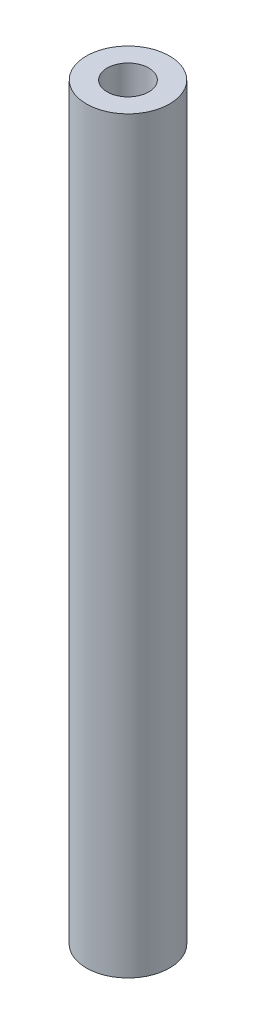
ISO-10303-21;
HEADER;
FILE_DESCRIPTION(('STEP AP214'),'2;1');
FILE_NAME('part.step','',(''),(''),'','','');
FILE_SCHEMA(('AUTOMOTIVE_DESIGN { 1 0 10303 214 1 1 1 1 }'));
ENDSEC;
DATA;
#1=APPLICATION_CONTEXT('core data for automotive mechanical design processes');
#2=APPLICATION_PROTOCOL_DEFINITION('international standard','automotive_design',2000,#1);
#3=PRODUCT_CONTEXT('',#1,'mechanical');
#4=PRODUCT('Part','Part','',(#3));
#5=PRODUCT_RELATED_PRODUCT_CATEGORY('part','',(#4));
#6=PRODUCT_DEFINITION_FORMATION('','',#4);
#7=PRODUCT_DEFINITION_CONTEXT('part definition',#1,'design');
#8=PRODUCT_DEFINITION('design','',#6,#7);
#9=PRODUCT_DEFINITION_SHAPE('','',#8);
#10=(LENGTH_UNIT() NAMED_UNIT(*) SI_UNIT(.MILLI.,.METRE.));
#11=(NAMED_UNIT(*) PLANE_ANGLE_UNIT() SI_UNIT($,.RADIAN.));
#12=(NAMED_UNIT(*) SI_UNIT($,.STERADIAN.) SOLID_ANGLE_UNIT());
#13=UNCERTAINTY_MEASURE_WITH_UNIT(LENGTH_MEASURE(1.E-05),#10,'distance_accuracy_value','');
#14=(GEOMETRIC_REPRESENTATION_CONTEXT(3) GLOBAL_UNCERTAINTY_ASSIGNED_CONTEXT((#13)) GLOBAL_UNIT_ASSIGNED_CONTEXT((#10,
#11,#12)) REPRESENTATION_CONTEXT('',''));
#15=CARTESIAN_POINT('',(0.,0.,0.));
#16=DIRECTION('',(0.,0.,1.));
#17=DIRECTION('',(1.,0.,0.));
#18=AXIS2_PLACEMENT_3D('',#15,#16,#17);
#19=CARTESIAN_POINT('',(0.,90.,0.));
#20=DIRECTION('',(0.,1.,0.));
#21=DIRECTION('',(0.,0.,1.));
#22=AXIS2_PLACEMENT_3D('',#19,#20,#21);
#23=PLANE('',#22);
#24=CARTESIAN_POINT('',(0.,90.,0.));
#25=DIRECTION('',(0.,1.,0.));
#26=DIRECTION('',(0.,0.,1.));
#27=AXIS2_PLACEMENT_3D('',#24,#25,#26);
#28=CIRCLE('',#27,5.);
#29=CARTESIAN_POINT('',(0.,90.,5.));
#30=VERTEX_POINT('',#29);
#31=EDGE_CURVE('E10',#30,#30,#28,.T.);
#32=ORIENTED_EDGE('',*,*,#31,.T.);
#33=EDGE_LOOP('',(#32));
#34=FACE_BOUND('',#33,.T.);
#35=CARTESIAN_POINT('',(0.,90.,0.));
#36=DIRECTION('',(0.,1.,0.));
#37=DIRECTION('',(0.,0.,1.));
#38=AXIS2_PLACEMENT_3D('',#35,#36,#37);
#39=CIRCLE('',#38,2.5);
#40=CARTESIAN_POINT('',(0.,90.,2.5));
#41=VERTEX_POINT('',#40);
#42=EDGE_CURVE('E41',#41,#41,#39,.T.);
#43=ORIENTED_EDGE('',*,*,#42,.F.);
#44=EDGE_LOOP('',(#43));
#45=FACE_BOUND('',#44,.T.);
#46=ADVANCED_FACE('F30',(#34,#45),#23,.T.);
#47=CARTESIAN_POINT('',(0.,0.,0.));
#48=DIRECTION('',(0.,1.,0.));
#49=DIRECTION('',(0.,0.,1.));
#50=AXIS2_PLACEMENT_3D('',#47,#48,#49);
#51=PLANE('',#50);
#52=CARTESIAN_POINT('',(0.,0.,0.));
#53=DIRECTION('',(0.,1.,0.));
#54=DIRECTION('',(0.,0.,1.));
#55=AXIS2_PLACEMENT_3D('',#52,#53,#54);
#56=CIRCLE('',#55,5.);
#57=CARTESIAN_POINT('',(0.,0.,5.));
#58=VERTEX_POINT('',#57);
#59=EDGE_CURVE('E34',#58,#58,#56,.T.);
#60=ORIENTED_EDGE('',*,*,#59,.F.);
#61=EDGE_LOOP('',(#60));
#62=FACE_BOUND('',#61,.T.);
#63=CARTESIAN_POINT('',(0.,0.,0.));
#64=DIRECTION('',(0.,1.,0.));
#65=DIRECTION('',(0.,0.,1.));
#66=AXIS2_PLACEMENT_3D('',#63,#64,#65);
#67=CIRCLE('',#66,2.5);
#68=CARTESIAN_POINT('',(0.,0.,2.5));
#69=VERTEX_POINT('',#68);
#70=EDGE_CURVE('E43',#69,#69,#67,.T.);
#71=ORIENTED_EDGE('',*,*,#70,.T.);
#72=EDGE_LOOP('',(#71));
#73=FACE_BOUND('',#72,.T.);
#74=ADVANCED_FACE('F53',(#62,#73),#51,.F.);
#75=CARTESIAN_POINT('',(0.,90.,0.));
#76=DIRECTION('',(0.,-1.,0.));
#77=DIRECTION('',(0.,0.,-1.));
#78=AXIS2_PLACEMENT_3D('',#75,#76,#77);
#79=CYLINDRICAL_SURFACE('',#78,5.);
#80=ORIENTED_EDGE('',*,*,#31,.F.);
#81=EDGE_LOOP('',(#80));
#82=FACE_BOUND('',#81,.T.);
#83=ORIENTED_EDGE('',*,*,#59,.T.);
#84=EDGE_LOOP('',(#83));
#85=FACE_BOUND('',#84,.T.);
#86=ADVANCED_FACE('F32',(#82,#85),#79,.T.);
#87=CARTESIAN_POINT('',(0.,90.,0.));
#88=DIRECTION('',(0.,-1.,0.));
#89=DIRECTION('',(0.,0.,-1.));
#90=AXIS2_PLACEMENT_3D('',#87,#88,#89);
#91=CYLINDRICAL_SURFACE('',#90,2.5);
#92=ORIENTED_EDGE('',*,*,#42,.T.);
#93=EDGE_LOOP('',(#92));
#94=FACE_BOUND('',#93,.T.);
#95=ORIENTED_EDGE('',*,*,#70,.F.);
#96=EDGE_LOOP('',(#95));
#97=FACE_BOUND('',#96,.T.);
#98=ADVANCED_FACE('F49',(#94,#97),#91,.F.);
#99=CLOSED_SHELL('',(#46,#74,#86,#98));
#100=MANIFOLD_SOLID_BREP('B2',#99);
#101=ADVANCED_BREP_SHAPE_REPRESENTATION('',(#18,#100),#14);
#102=SHAPE_DEFINITION_REPRESENTATION(#9,#101);
ENDSEC;
END-ISO-10303-21;
